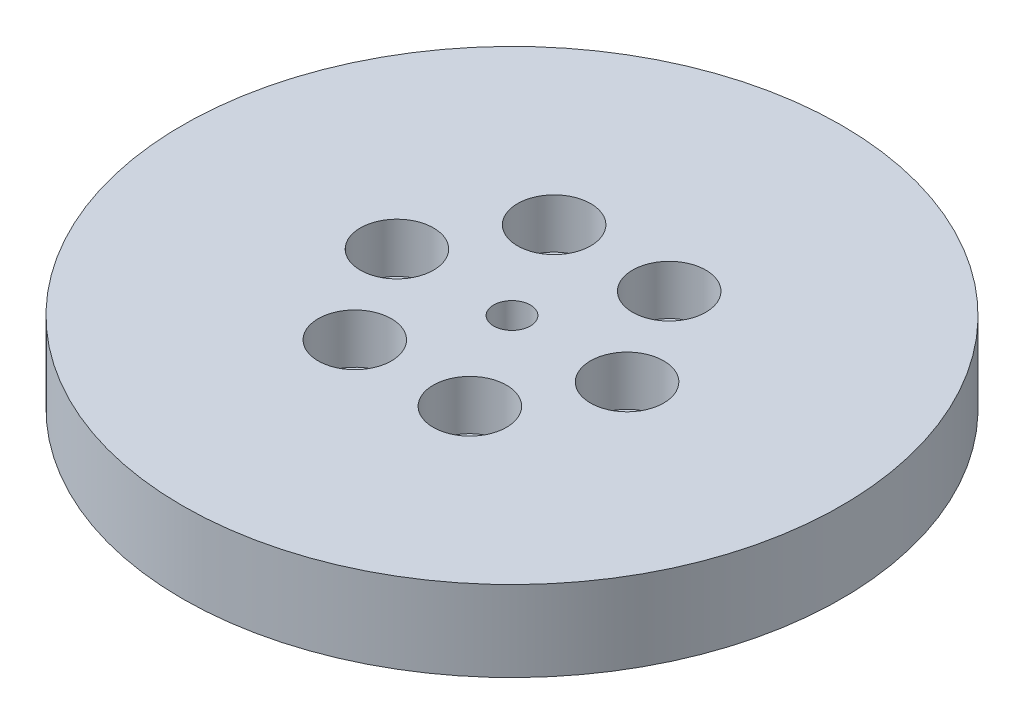
ISO-10303-21;
HEADER;
FILE_DESCRIPTION(('STEP AP214'),'2;1');
FILE_NAME('part.step','',(''),(''),'','','');
FILE_SCHEMA(('AUTOMOTIVE_DESIGN { 1 0 10303 214 1 1 1 1 }'));
ENDSEC;
DATA;
#1=APPLICATION_CONTEXT('core data for automotive mechanical design processes');
#2=APPLICATION_PROTOCOL_DEFINITION('international standard','automotive_design',2000,#1);
#3=PRODUCT_CONTEXT('',#1,'mechanical');
#4=PRODUCT('Part','Part','',(#3));
#5=PRODUCT_RELATED_PRODUCT_CATEGORY('part','',(#4));
#6=PRODUCT_DEFINITION_FORMATION('','',#4);
#7=PRODUCT_DEFINITION_CONTEXT('part definition',#1,'design');
#8=PRODUCT_DEFINITION('design','',#6,#7);
#9=PRODUCT_DEFINITION_SHAPE('','',#8);
#10=(LENGTH_UNIT() NAMED_UNIT(*) SI_UNIT(.MILLI.,.METRE.));
#11=(NAMED_UNIT(*) PLANE_ANGLE_UNIT() SI_UNIT($,.RADIAN.));
#12=(NAMED_UNIT(*) SI_UNIT($,.STERADIAN.) SOLID_ANGLE_UNIT());
#13=UNCERTAINTY_MEASURE_WITH_UNIT(LENGTH_MEASURE(1.E-05),#10,'distance_accuracy_value','');
#14=(GEOMETRIC_REPRESENTATION_CONTEXT(3) GLOBAL_UNCERTAINTY_ASSIGNED_CONTEXT((#13)) GLOBAL_UNIT_ASSIGNED_CONTEXT((#10,
#11,#12)) REPRESENTATION_CONTEXT('',''));
#15=CARTESIAN_POINT('',(0.,0.,0.));
#16=DIRECTION('',(0.,0.,1.));
#17=DIRECTION('',(1.,0.,0.));
#18=AXIS2_PLACEMENT_3D('',#15,#16,#17);
#19=CARTESIAN_POINT('',(0.,22.,0.));
#20=DIRECTION('',(0.,-1.,0.));
#21=DIRECTION('',(0.,0.,-1.));
#22=AXIS2_PLACEMENT_3D('',#19,#20,#21);
#23=CYLINDRICAL_SURFACE('',#22,90.);
#24=CARTESIAN_POINT('',(0.,22.,0.));
#25=DIRECTION('',(0.,1.,0.));
#26=DIRECTION('',(0.,0.,1.));
#27=AXIS2_PLACEMENT_3D('',#24,#25,#26);
#28=CIRCLE('',#27,90.);
#29=CARTESIAN_POINT('',(0.,22.,90.));
#30=VERTEX_POINT('',#29);
#31=EDGE_CURVE('E10',#30,#30,#28,.T.);
#32=ORIENTED_EDGE('',*,*,#31,.F.);
#33=EDGE_LOOP('',(#32));
#34=FACE_BOUND('',#33,.T.);
#35=CARTESIAN_POINT('',(0.,0.,0.));
#36=DIRECTION('',(0.,1.,0.));
#37=DIRECTION('',(0.,0.,1.));
#38=AXIS2_PLACEMENT_3D('',#35,#36,#37);
#39=CIRCLE('',#38,90.);
#40=CARTESIAN_POINT('',(0.,0.,90.));
#41=VERTEX_POINT('',#40);
#42=EDGE_CURVE('E37',#41,#41,#39,.T.);
#43=ORIENTED_EDGE('',*,*,#42,.T.);
#44=EDGE_LOOP('',(#43));
#45=FACE_BOUND('',#44,.T.);
#46=ADVANCED_FACE('F40',(#34,#45),#23,.T.);
#47=CARTESIAN_POINT('',(0.,22.,0.));
#48=DIRECTION('',(0.,1.,0.));
#49=DIRECTION('',(0.,0.,1.));
#50=AXIS2_PLACEMENT_3D('',#47,#48,#49);
#51=PLANE('',#50);
#52=CARTESIAN_POINT('',(-15.7137685072552,22.,-27.217045432941));
#53=DIRECTION('',(0.,1.,0.));
#54=DIRECTION('',(-0.866025403784433,0.,0.50000000000001));
#55=AXIS2_PLACEMENT_3D('',#52,#53,#54);
#56=CIRCLE('',#55,10.);
#57=CARTESIAN_POINT('',(-24.3740225450995,22.,-22.2170454329409));
#58=VERTEX_POINT('',#57);
#59=EDGE_CURVE('E70',#58,#58,#56,.T.);
#60=ORIENTED_EDGE('',*,*,#59,.F.);
#61=EDGE_LOOP('',(#60));
#62=FACE_BOUND('',#61,.T.);
#63=CARTESIAN_POINT('',(15.7137685072546,22.,-27.2170454329414));
#64=DIRECTION('',(0.,1.,0.));
#65=DIRECTION('',(-0.866025403784443,0.,-0.499999999999992));
#66=AXIS2_PLACEMENT_3D('',#63,#64,#65);
#67=CIRCLE('',#66,10.);
#68=CARTESIAN_POINT('',(7.0535144694102,22.,-32.2170454329413));
#69=VERTEX_POINT('',#68);
#70=EDGE_CURVE('E71',#69,#69,#67,.T.);
#71=ORIENTED_EDGE('',*,*,#70,.F.);
#72=EDGE_LOOP('',(#71));
#73=FACE_BOUND('',#72,.T.);
#74=CARTESIAN_POINT('',(31.4275370145098,22.,0.));
#75=DIRECTION('',(0.,1.,0.));
#76=DIRECTION('',(0.,0.,-1.));
#77=AXIS2_PLACEMENT_3D('',#74,#75,#76);
#78=CIRCLE('',#77,10.);
#79=CARTESIAN_POINT('',(31.4275370145098,22.,-10.));
#80=VERTEX_POINT('',#79);
#81=EDGE_CURVE('E78',#80,#80,#78,.T.);
#82=ORIENTED_EDGE('',*,*,#81,.F.);
#83=EDGE_LOOP('',(#82));
#84=FACE_BOUND('',#83,.T.);
#85=CARTESIAN_POINT('',(15.713768507255,22.,27.2170454329411));
#86=DIRECTION('',(0.,1.,0.));
#87=DIRECTION('',(0.866025403784436,0.,-0.500000000000004));
#88=AXIS2_PLACEMENT_3D('',#85,#86,#87);
#89=CIRCLE('',#88,10.);
#90=CARTESIAN_POINT('',(24.3740225450994,22.,22.2170454329411));
#91=VERTEX_POINT('',#90);
#92=EDGE_CURVE('E84',#91,#91,#89,.T.);
#93=ORIENTED_EDGE('',*,*,#92,.F.);
#94=EDGE_LOOP('',(#93));
#95=FACE_BOUND('',#94,.T.);
#96=CARTESIAN_POINT('',(-15.7137685072548,22.,27.2170454329412));
#97=DIRECTION('',(0.,1.,0.));
#98=DIRECTION('',(0.86602540378444,0.,0.499999999999998));
#99=AXIS2_PLACEMENT_3D('',#96,#97,#98);
#100=CIRCLE('',#99,10.);
#101=CARTESIAN_POINT('',(-7.05351446941042,22.,32.2170454329412));
#102=VERTEX_POINT('',#101);
#103=EDGE_CURVE('E61',#102,#102,#100,.T.);
#104=ORIENTED_EDGE('',*,*,#103,.F.);
#105=EDGE_LOOP('',(#104));
#106=FACE_BOUND('',#105,.T.);
#107=CARTESIAN_POINT('',(-31.4275370145098,22.,0.));
#108=DIRECTION('',(0.,1.,0.));
#109=DIRECTION('',(0.,0.,1.));
#110=AXIS2_PLACEMENT_3D('',#107,#108,#109);
#111=CIRCLE('',#110,10.);
#112=CARTESIAN_POINT('',(-31.4275370145098,22.,10.));
#113=VERTEX_POINT('',#112);
#114=EDGE_CURVE('E54',#113,#113,#111,.T.);
#115=ORIENTED_EDGE('',*,*,#114,.F.);
#116=EDGE_LOOP('',(#115));
#117=FACE_BOUND('',#116,.T.);
#118=CARTESIAN_POINT('',(0.,22.,0.));
#119=DIRECTION('',(0.,1.,0.));
#120=DIRECTION('',(0.,0.,1.));
#121=AXIS2_PLACEMENT_3D('',#118,#119,#120);
#122=CIRCLE('',#121,5.);
#123=CARTESIAN_POINT('',(0.,22.,5.));
#124=VERTEX_POINT('',#123);
#125=EDGE_CURVE('E50',#124,#124,#122,.T.);
#126=ORIENTED_EDGE('',*,*,#125,.F.);
#127=EDGE_LOOP('',(#126));
#128=FACE_BOUND('',#127,.T.);
#129=ORIENTED_EDGE('',*,*,#31,.T.);
#130=EDGE_LOOP('',(#129));
#131=FACE_BOUND('',#130,.T.);
#132=ADVANCED_FACE('F99',(#62,#73,#84,#95,#106,#117,#128,#131),#51,.T.);
#133=CARTESIAN_POINT('',(0.,0.,0.));
#134=DIRECTION('',(0.,1.,0.));
#135=DIRECTION('',(0.,0.,1.));
#136=AXIS2_PLACEMENT_3D('',#133,#134,#135);
#137=PLANE('',#136);
#138=CARTESIAN_POINT('',(0.,0.,0.));
#139=DIRECTION('',(0.,1.,0.));
#140=DIRECTION('',(0.,0.,1.));
#141=AXIS2_PLACEMENT_3D('',#138,#139,#140);
#142=CIRCLE('',#141,5.);
#143=CARTESIAN_POINT('',(0.,0.,5.));
#144=VERTEX_POINT('',#143);
#145=EDGE_CURVE('E47',#144,#144,#142,.T.);
#146=ORIENTED_EDGE('',*,*,#145,.T.);
#147=EDGE_LOOP('',(#146));
#148=FACE_BOUND('',#147,.T.);
#149=ORIENTED_EDGE('',*,*,#42,.F.);
#150=EDGE_LOOP('',(#149));
#151=FACE_BOUND('',#150,.T.);
#152=ADVANCED_FACE('F103',(#148,#151),#137,.F.);
#153=CARTESIAN_POINT('',(0.,22.,0.));
#154=DIRECTION('',(0.,-1.,0.));
#155=DIRECTION('',(0.,0.,-1.));
#156=AXIS2_PLACEMENT_3D('',#153,#154,#155);
#157=CYLINDRICAL_SURFACE('',#156,5.);
#158=ORIENTED_EDGE('',*,*,#125,.T.);
#159=EDGE_LOOP('',(#158));
#160=FACE_BOUND('',#159,.T.);
#161=ORIENTED_EDGE('',*,*,#145,.F.);
#162=EDGE_LOOP('',(#161));
#163=FACE_BOUND('',#162,.T.);
#164=ADVANCED_FACE('F115',(#160,#163),#157,.F.);
#165=CARTESIAN_POINT('',(-31.4275370145098,8.44755913181468,0.));
#166=DIRECTION('',(0.,1.,0.));
#167=DIRECTION('',(0.,0.,1.));
#168=AXIS2_PLACEMENT_3D('',#165,#166,#167);
#169=CYLINDRICAL_SURFACE('',#168,10.);
#170=CARTESIAN_POINT('',(-31.4275370145098,8.44755913181468,0.));
#171=DIRECTION('',(0.,1.,0.));
#172=DIRECTION('',(0.,0.,1.));
#173=AXIS2_PLACEMENT_3D('',#170,#171,#172);
#174=CIRCLE('',#173,10.);
#175=CARTESIAN_POINT('',(-31.4275370145098,8.44755913181468,10.));
#176=VERTEX_POINT('',#175);
#177=EDGE_CURVE('E55',#176,#176,#174,.T.);
#178=ORIENTED_EDGE('',*,*,#177,.F.);
#179=EDGE_LOOP('',(#178));
#180=FACE_BOUND('',#179,.T.);
#181=ORIENTED_EDGE('',*,*,#114,.T.);
#182=EDGE_LOOP('',(#181));
#183=FACE_BOUND('',#182,.T.);
#184=ADVANCED_FACE('F113',(#180,#183),#169,.F.);
#185=CARTESIAN_POINT('',(-31.4275370145098,8.44755913181468,0.));
#186=DIRECTION('',(0.,1.,0.));
#187=DIRECTION('',(0.,0.,1.));
#188=AXIS2_PLACEMENT_3D('',#185,#186,#187);
#189=PLANE('',#188);
#190=ORIENTED_EDGE('',*,*,#177,.T.);
#191=EDGE_LOOP('',(#190));
#192=FACE_BOUND('',#191,.T.);
#193=ADVANCED_FACE('F144',(#192),#189,.T.);
#194=CARTESIAN_POINT('',(-15.7137685072548,8.44755913181468,27.2170454329412));
#195=DIRECTION('',(0.,1.,0.));
#196=DIRECTION('',(0.,0.,1.));
#197=AXIS2_PLACEMENT_3D('',#194,#195,#196);
#198=CYLINDRICAL_SURFACE('',#197,10.);
#199=CARTESIAN_POINT('',(-15.7137685072548,8.44755913181468,27.2170454329412));
#200=DIRECTION('',(0.,1.,0.));
#201=DIRECTION('',(0.86602540378444,0.,0.499999999999998));
#202=AXIS2_PLACEMENT_3D('',#199,#200,#201);
#203=CIRCLE('',#202,10.);
#204=CARTESIAN_POINT('',(-7.05351446941042,8.44755913181468,32.2170454329412));
#205=VERTEX_POINT('',#204);
#206=EDGE_CURVE('E59',#205,#205,#203,.T.);
#207=ORIENTED_EDGE('',*,*,#206,.F.);
#208=EDGE_LOOP('',(#207));
#209=FACE_BOUND('',#208,.T.);
#210=ORIENTED_EDGE('',*,*,#103,.T.);
#211=EDGE_LOOP('',(#210));
#212=FACE_BOUND('',#211,.T.);
#213=ADVANCED_FACE('F153',(#209,#212),#198,.F.);
#214=CARTESIAN_POINT('',(-15.7137685072548,8.44755913181468,27.2170454329412));
#215=DIRECTION('',(0.,1.,0.));
#216=DIRECTION('',(0.86602540378444,0.,0.499999999999998));
#217=AXIS2_PLACEMENT_3D('',#214,#215,#216);
#218=PLANE('',#217);
#219=ORIENTED_EDGE('',*,*,#206,.T.);
#220=EDGE_LOOP('',(#219));
#221=FACE_BOUND('',#220,.T.);
#222=ADVANCED_FACE('F96',(#221),#218,.T.);
#223=CARTESIAN_POINT('',(15.713768507255,8.44755913181468,27.2170454329411));
#224=DIRECTION('',(0.,1.,0.));
#225=DIRECTION('',(0.,0.,1.));
#226=AXIS2_PLACEMENT_3D('',#223,#224,#225);
#227=CYLINDRICAL_SURFACE('',#226,10.);
#228=CARTESIAN_POINT('',(15.713768507255,8.44755913181468,27.2170454329411));
#229=DIRECTION('',(0.,1.,0.));
#230=DIRECTION('',(0.866025403784436,0.,-0.500000000000004));
#231=AXIS2_PLACEMENT_3D('',#228,#229,#230);
#232=CIRCLE('',#231,10.);
#233=CARTESIAN_POINT('',(24.3740225450994,8.44755913181468,22.2170454329411));
#234=VERTEX_POINT('',#233);
#235=EDGE_CURVE('E63',#234,#234,#232,.T.);
#236=ORIENTED_EDGE('',*,*,#235,.F.);
#237=EDGE_LOOP('',(#236));
#238=FACE_BOUND('',#237,.T.);
#239=ORIENTED_EDGE('',*,*,#92,.T.);
#240=EDGE_LOOP('',(#239));
#241=FACE_BOUND('',#240,.T.);
#242=ADVANCED_FACE('F91',(#238,#241),#227,.F.);
#243=CARTESIAN_POINT('',(15.713768507255,8.44755913181468,27.2170454329411));
#244=DIRECTION('',(0.,1.,0.));
#245=DIRECTION('',(0.866025403784436,0.,-0.500000000000004));
#246=AXIS2_PLACEMENT_3D('',#243,#244,#245);
#247=PLANE('',#246);
#248=ORIENTED_EDGE('',*,*,#235,.T.);
#249=EDGE_LOOP('',(#248));
#250=FACE_BOUND('',#249,.T.);
#251=ADVANCED_FACE('F93',(#250),#247,.T.);
#252=CARTESIAN_POINT('',(31.4275370145098,8.44755913181468,0.));
#253=DIRECTION('',(0.,1.,0.));
#254=DIRECTION('',(0.,0.,1.));
#255=AXIS2_PLACEMENT_3D('',#252,#253,#254);
#256=CYLINDRICAL_SURFACE('',#255,10.);
#257=CARTESIAN_POINT('',(31.4275370145098,8.44755913181468,0.));
#258=DIRECTION('',(0.,1.,0.));
#259=DIRECTION('',(0.,0.,-1.));
#260=AXIS2_PLACEMENT_3D('',#257,#258,#259);
#261=CIRCLE('',#260,10.);
#262=CARTESIAN_POINT('',(31.4275370145098,8.44755913181468,-10.));
#263=VERTEX_POINT('',#262);
#264=EDGE_CURVE('E85',#263,#263,#261,.T.);
#265=ORIENTED_EDGE('',*,*,#264,.F.);
#266=EDGE_LOOP('',(#265));
#267=FACE_BOUND('',#266,.T.);
#268=ORIENTED_EDGE('',*,*,#81,.T.);
#269=EDGE_LOOP('',(#268));
#270=FACE_BOUND('',#269,.T.);
#271=ADVANCED_FACE('F187',(#267,#270),#256,.F.);
#272=CARTESIAN_POINT('',(31.4275370145098,8.44755913181468,0.));
#273=DIRECTION('',(0.,1.,0.));
#274=DIRECTION('',(0.,0.,-1.));
#275=AXIS2_PLACEMENT_3D('',#272,#273,#274);
#276=PLANE('',#275);
#277=ORIENTED_EDGE('',*,*,#264,.T.);
#278=EDGE_LOOP('',(#277));
#279=FACE_BOUND('',#278,.T.);
#280=ADVANCED_FACE('F198',(#279),#276,.T.);
#281=CARTESIAN_POINT('',(15.7137685072546,8.44755913181468,-27.2170454329414));
#282=DIRECTION('',(0.,1.,0.));
#283=DIRECTION('',(0.,0.,1.));
#284=AXIS2_PLACEMENT_3D('',#281,#282,#283);
#285=CYLINDRICAL_SURFACE('',#284,10.);
#286=CARTESIAN_POINT('',(15.7137685072546,8.44755913181468,-27.2170454329414));
#287=DIRECTION('',(0.,1.,0.));
#288=DIRECTION('',(-0.866025403784443,0.,-0.499999999999992));
#289=AXIS2_PLACEMENT_3D('',#286,#287,#288);
#290=CIRCLE('',#289,10.);
#291=CARTESIAN_POINT('',(7.0535144694102,8.44755913181468,-32.2170454329413));
#292=VERTEX_POINT('',#291);
#293=EDGE_CURVE('E76',#292,#292,#290,.T.);
#294=ORIENTED_EDGE('',*,*,#293,.F.);
#295=EDGE_LOOP('',(#294));
#296=FACE_BOUND('',#295,.T.);
#297=ORIENTED_EDGE('',*,*,#70,.T.);
#298=EDGE_LOOP('',(#297));
#299=FACE_BOUND('',#298,.T.);
#300=ADVANCED_FACE('F202',(#296,#299),#285,.F.);
#301=CARTESIAN_POINT('',(15.7137685072546,8.44755913181468,-27.2170454329414));
#302=DIRECTION('',(0.,1.,0.));
#303=DIRECTION('',(-0.866025403784443,0.,-0.499999999999992));
#304=AXIS2_PLACEMENT_3D('',#301,#302,#303);
#305=PLANE('',#304);
#306=ORIENTED_EDGE('',*,*,#293,.T.);
#307=EDGE_LOOP('',(#306));
#308=FACE_BOUND('',#307,.T.);
#309=ADVANCED_FACE('F212',(#308),#305,.T.);
#310=CARTESIAN_POINT('',(-15.7137685072552,8.44755913181468,-27.217045432941));
#311=DIRECTION('',(0.,1.,0.));
#312=DIRECTION('',(0.,0.,1.));
#313=AXIS2_PLACEMENT_3D('',#310,#311,#312);
#314=CYLINDRICAL_SURFACE('',#313,10.);
#315=CARTESIAN_POINT('',(-15.7137685072552,8.44755913181468,-27.217045432941));
#316=DIRECTION('',(0.,1.,0.));
#317=DIRECTION('',(-0.866025403784433,0.,0.50000000000001));
#318=AXIS2_PLACEMENT_3D('',#315,#316,#317);
#319=CIRCLE('',#318,10.);
#320=CARTESIAN_POINT('',(-24.3740225450995,8.44755913181468,-22.2170454329409));
#321=VERTEX_POINT('',#320);
#322=EDGE_CURVE('E69',#321,#321,#319,.T.);
#323=ORIENTED_EDGE('',*,*,#322,.F.);
#324=EDGE_LOOP('',(#323));
#325=FACE_BOUND('',#324,.T.);
#326=ORIENTED_EDGE('',*,*,#59,.T.);
#327=EDGE_LOOP('',(#326));
#328=FACE_BOUND('',#327,.T.);
#329=ADVANCED_FACE('F224',(#325,#328),#314,.F.);
#330=CARTESIAN_POINT('',(-15.7137685072552,8.44755913181468,-27.217045432941));
#331=DIRECTION('',(0.,1.,0.));
#332=DIRECTION('',(-0.866025403784433,0.,0.50000000000001));
#333=AXIS2_PLACEMENT_3D('',#330,#331,#332);
#334=PLANE('',#333);
#335=ORIENTED_EDGE('',*,*,#322,.T.);
#336=EDGE_LOOP('',(#335));
#337=FACE_BOUND('',#336,.T.);
#338=ADVANCED_FACE('F235',(#337),#334,.T.);
#339=CLOSED_SHELL('',(#46,#132,#152,#164,#184,#193,#213,#222,#242,#251,#271,#280,#300,#309,#329,#338));
#340=MANIFOLD_SOLID_BREP('B2',#339);
#341=ADVANCED_BREP_SHAPE_REPRESENTATION('',(#18,#340),#14);
#342=SHAPE_DEFINITION_REPRESENTATION(#9,#341);
ENDSEC;
END-ISO-10303-21;
